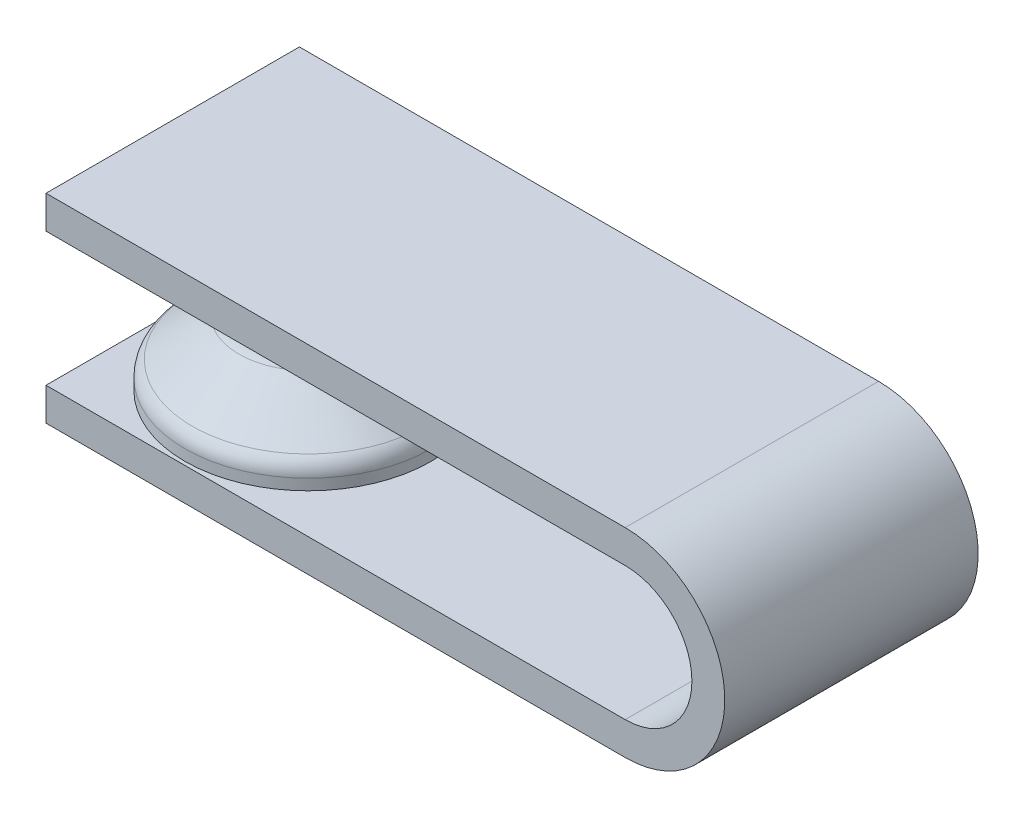
ISO-10303-21;
HEADER;
FILE_DESCRIPTION(('STEP AP214'),'2;1');
FILE_NAME('part.step','',(''),(''),'','','');
FILE_SCHEMA(('AUTOMOTIVE_DESIGN { 1 0 10303 214 1 1 1 1 }'));
ENDSEC;
DATA;
#1=APPLICATION_CONTEXT('core data for automotive mechanical design processes');
#2=APPLICATION_PROTOCOL_DEFINITION('international standard','automotive_design',2000,#1);
#3=PRODUCT_CONTEXT('',#1,'mechanical');
#4=PRODUCT('Part','Part','',(#3));
#5=PRODUCT_RELATED_PRODUCT_CATEGORY('part','',(#4));
#6=PRODUCT_DEFINITION_FORMATION('','',#4);
#7=PRODUCT_DEFINITION_CONTEXT('part definition',#1,'design');
#8=PRODUCT_DEFINITION('design','',#6,#7);
#9=PRODUCT_DEFINITION_SHAPE('','',#8);
#10=(LENGTH_UNIT() NAMED_UNIT(*) SI_UNIT(.MILLI.,.METRE.));
#11=(NAMED_UNIT(*) PLANE_ANGLE_UNIT() SI_UNIT($,.RADIAN.));
#12=(NAMED_UNIT(*) SI_UNIT($,.STERADIAN.) SOLID_ANGLE_UNIT());
#13=UNCERTAINTY_MEASURE_WITH_UNIT(LENGTH_MEASURE(1.E-05),#10,'distance_accuracy_value','');
#14=(GEOMETRIC_REPRESENTATION_CONTEXT(3) GLOBAL_UNCERTAINTY_ASSIGNED_CONTEXT((#13)) GLOBAL_UNIT_ASSIGNED_CONTEXT((#10,
#11,#12)) REPRESENTATION_CONTEXT('',''));
#15=CARTESIAN_POINT('',(0.,0.,0.));
#16=DIRECTION('',(0.,0.,1.));
#17=DIRECTION('',(1.,0.,0.));
#18=AXIS2_PLACEMENT_3D('',#15,#16,#17);
#19=CARTESIAN_POINT('',(0.,-1.,0.));
#20=DIRECTION('',(0.,-1.,0.));
#21=DIRECTION('',(1.,0.,0.));
#22=AXIS2_PLACEMENT_3D('',#19,#20,#21);
#23=CYLINDRICAL_SURFACE('',#22,3.);
#24=CARTESIAN_POINT('',(0.,4.,0.));
#25=DIRECTION('',(0.,-1.,0.));
#26=DIRECTION('',(1.,0.,0.));
#27=AXIS2_PLACEMENT_3D('',#24,#25,#26);
#28=CIRCLE('',#27,3.);
#29=CARTESIAN_POINT('',(3.,4.,0.));
#30=VERTEX_POINT('',#29);
#31=EDGE_CURVE('E142',#30,#30,#28,.T.);
#32=ORIENTED_EDGE('',*,*,#31,.T.);
#33=EDGE_LOOP('',(#32));
#34=FACE_BOUND('',#33,.T.);
#35=CARTESIAN_POINT('',(0.,2.96837494598444,0.));
#36=DIRECTION('',(0.,-1.,0.));
#37=DIRECTION('',(1.,0.,0.));
#38=AXIS2_PLACEMENT_3D('',#35,#36,#37);
#39=CIRCLE('',#38,3.);
#40=CARTESIAN_POINT('',(3.,2.96837494598444,0.));
#41=VERTEX_POINT('',#40);
#42=EDGE_CURVE('E139',#41,#41,#39,.F.);
#43=ORIENTED_EDGE('',*,*,#42,.T.);
#44=EDGE_LOOP('',(#43));
#45=FACE_BOUND('',#44,.T.);
#46=ADVANCED_FACE('F35',(#34,#45),#23,.T.);
#47=CARTESIAN_POINT('',(0.,2.5,0.));
#48=DIRECTION('',(0.,-1.,0.));
#49=DIRECTION('',(1.,0.,0.));
#50=AXIS2_PLACEMENT_3D('',#47,#48,#49);
#51=CONICAL_SURFACE('',#50,3.,0.876058050598194);
#52=CARTESIAN_POINT('',(0.,2.20015366638707,0.));
#53=DIRECTION('',(0.,-1.,0.));
#54=DIRECTION('',(1.,0.,0.));
#55=AXIS2_PLACEMENT_3D('',#52,#53,#54);
#56=CIRCLE('',#55,3.35981560033552);
#57=CARTESIAN_POINT('',(3.35981560033552,2.20015366638707,0.));
#58=VERTEX_POINT('',#57);
#59=EDGE_CURVE('E44',#58,#58,#56,.T.);
#60=ORIENTED_EDGE('',*,*,#59,.T.);
#61=EDGE_LOOP('',(#60));
#62=FACE_BOUND('',#61,.T.);
#63=CARTESIAN_POINT('',(0.,0.299846333612934,0.));
#64=DIRECTION('',(0.,1.,0.));
#65=DIRECTION('',(-1.,0.,0.));
#66=AXIS2_PLACEMENT_3D('',#63,#64,#65);
#67=CIRCLE('',#66,5.64018439966448);
#68=CARTESIAN_POINT('',(-5.64018439966448,0.299846333612934,0.));
#69=VERTEX_POINT('',#68);
#70=EDGE_CURVE('E148',#69,#69,#67,.T.);
#71=ORIENTED_EDGE('',*,*,#70,.T.);
#72=EDGE_LOOP('',(#71));
#73=FACE_BOUND('',#72,.T.);
#74=ADVANCED_FACE('F153',(#62,#73),#51,.T.);
#75=CARTESIAN_POINT('',(0.,-1.,0.));
#76=DIRECTION('',(0.,-1.,0.));
#77=DIRECTION('',(1.,0.,0.));
#78=AXIS2_PLACEMENT_3D('',#75,#76,#77);
#79=CYLINDRICAL_SURFACE('',#78,6.);
#80=CARTESIAN_POINT('',(0.,-0.468374945984442,0.));
#81=DIRECTION('',(0.,1.,0.));
#82=DIRECTION('',(-1.,0.,0.));
#83=AXIS2_PLACEMENT_3D('',#80,#81,#82);
#84=CIRCLE('',#83,6.);
#85=CARTESIAN_POINT('',(-6.,-0.468374945984443,0.));
#86=VERTEX_POINT('',#85);
#87=EDGE_CURVE('E11',#86,#86,#84,.F.);
#88=ORIENTED_EDGE('',*,*,#87,.T.);
#89=EDGE_LOOP('',(#88));
#90=FACE_BOUND('',#89,.T.);
#91=CARTESIAN_POINT('',(0.,-0.999999999999999,0.));
#92=DIRECTION('',(0.,-1.,0.));
#93=DIRECTION('',(1.,0.,0.));
#94=AXIS2_PLACEMENT_3D('',#91,#92,#93);
#95=CIRCLE('',#94,6.);
#96=CARTESIAN_POINT('',(6.,-0.999999999999998,0.));
#97=VERTEX_POINT('',#96);
#98=EDGE_CURVE('E136',#97,#97,#95,.T.);
#99=ORIENTED_EDGE('',*,*,#98,.F.);
#100=EDGE_LOOP('',(#99));
#101=FACE_BOUND('',#100,.T.);
#102=ADVANCED_FACE('F176',(#90,#101),#79,.T.);
#103=CARTESIAN_POINT('',(0.,5.,0.));
#104=DIRECTION('',(0.,-1.,0.));
#105=DIRECTION('',(1.,0.,0.));
#106=AXIS2_PLACEMENT_3D('',#103,#104,#105);
#107=PLANE('',#106);
#108=CARTESIAN_POINT('',(0.,5.,0.));
#109=DIRECTION('',(0.,-1.,0.));
#110=DIRECTION('',(1.,0.,0.));
#111=AXIS2_PLACEMENT_3D('',#108,#109,#110);
#112=CIRCLE('',#111,2.);
#113=CARTESIAN_POINT('',(2.,5.,0.));
#114=VERTEX_POINT('',#113);
#115=EDGE_CURVE('E145',#114,#114,#112,.F.);
#116=ORIENTED_EDGE('',*,*,#115,.T.);
#117=EDGE_LOOP('',(#116));
#118=FACE_BOUND('',#117,.T.);
#119=ADVANCED_FACE('F166',(#118),#107,.F.);
#120=CARTESIAN_POINT('',(0.,4.,0.));
#121=DIRECTION('',(0.,-1.,0.));
#122=DIRECTION('',(1.,0.,0.));
#123=AXIS2_PLACEMENT_3D('',#120,#121,#122);
#124=TOROIDAL_SURFACE('',#123,2.,1.);
#125=ORIENTED_EDGE('',*,*,#115,.F.);
#126=EDGE_LOOP('',(#125));
#127=FACE_BOUND('',#126,.T.);
#128=ORIENTED_EDGE('',*,*,#31,.F.);
#129=EDGE_LOOP('',(#128));
#130=FACE_BOUND('',#129,.T.);
#131=ADVANCED_FACE('F158',(#127,#130),#124,.T.);
#132=CARTESIAN_POINT('',(0.,2.96837494598444,0.));
#133=DIRECTION('',(0.,-1.,0.));
#134=DIRECTION('',(1.,0.,0.));
#135=AXIS2_PLACEMENT_3D('',#132,#133,#134);
#136=TOROIDAL_SURFACE('',#135,4.,1.);
#137=ORIENTED_EDGE('',*,*,#42,.F.);
#138=EDGE_LOOP('',(#137));
#139=FACE_BOUND('',#138,.T.);
#140=ORIENTED_EDGE('',*,*,#59,.F.);
#141=EDGE_LOOP('',(#140));
#142=FACE_BOUND('',#141,.T.);
#143=ADVANCED_FACE('F156',(#139,#142),#136,.F.);
#144=CARTESIAN_POINT('',(0.,-0.468374945984442,0.));
#145=DIRECTION('',(0.,1.,0.));
#146=DIRECTION('',(-1.,0.,0.));
#147=AXIS2_PLACEMENT_3D('',#144,#145,#146);
#148=TOROIDAL_SURFACE('',#147,5.,1.);
#149=ORIENTED_EDGE('',*,*,#70,.F.);
#150=EDGE_LOOP('',(#149));
#151=FACE_BOUND('',#150,.T.);
#152=ORIENTED_EDGE('',*,*,#87,.F.);
#153=EDGE_LOOP('',(#152));
#154=FACE_BOUND('',#153,.T.);
#155=ADVANCED_FACE('F37',(#151,#154),#148,.T.);
#156=CARTESIAN_POINT('',(-6.59323512510923,-2.6,6.17069615537602));
#157=DIRECTION('',(0.,0.,-1.));
#158=DIRECTION('',(-1.,0.,0.));
#159=AXIS2_PLACEMENT_3D('',#156,#157,#158);
#160=PLANE('',#159);
#161=DIRECTION('',(-1.,0.,0.));
#162=VECTOR('',#161,1.);
#163=CARTESIAN_POINT('',(-6.59323512510923,-1.,6.17069615537602));
#164=LINE('',#163,#162);
#165=CARTESIAN_POINT('',(21.6163662570743,-0.999999999999999,6.17069615537602));
#166=VERTEX_POINT('',#165);
#167=CARTESIAN_POINT('',(-6.59323512510923,-1.,6.17069615537602));
#168=VERTEX_POINT('',#167);
#169=EDGE_CURVE('E63',#166,#168,#164,.T.);
#170=ORIENTED_EDGE('',*,*,#169,.T.);
#171=DIRECTION('',(0.,1.,0.));
#172=VECTOR('',#171,1.);
#173=CARTESIAN_POINT('',(-6.59323512510923,-2.6,6.17069615537602));
#174=LINE('',#173,#172);
#175=CARTESIAN_POINT('',(-6.59323512510923,-2.6,6.17069615537602));
#176=VERTEX_POINT('',#175);
#177=EDGE_CURVE('E134',#176,#168,#174,.T.);
#178=ORIENTED_EDGE('',*,*,#177,.F.);
#179=DIRECTION('',(-1.,0.,0.));
#180=VECTOR('',#179,1.);
#181=CARTESIAN_POINT('',(-6.59323512510923,-2.6,6.17069615537602));
#182=LINE('',#181,#180);
#183=CARTESIAN_POINT('',(21.6163662570743,-2.6,6.17069615537602));
#184=VERTEX_POINT('',#183);
#185=EDGE_CURVE('E124',#184,#176,#182,.T.);
#186=ORIENTED_EDGE('',*,*,#185,.F.);
#187=CARTESIAN_POINT('',(21.6163662570743,2.25,6.17069615537602));
#188=DIRECTION('',(0.,0.,1.));
#189=DIRECTION('',(-1.,0.,0.));
#190=AXIS2_PLACEMENT_3D('',#187,#188,#189);
#191=CIRCLE('',#190,4.85);
#192=CARTESIAN_POINT('',(21.6163662570743,7.1,6.17069615537602));
#193=VERTEX_POINT('',#192);
#194=EDGE_CURVE('E116',#184,#193,#191,.T.);
#195=ORIENTED_EDGE('',*,*,#194,.T.);
#196=DIRECTION('',(-1.,0.,0.));
#197=VECTOR('',#196,1.);
#198=CARTESIAN_POINT('',(6.59323512510923,7.1,6.17069615537602));
#199=LINE('',#198,#197);
#200=CARTESIAN_POINT('',(-6.59323512510923,7.1,6.17069615537602));
#201=VERTEX_POINT('',#200);
#202=EDGE_CURVE('E243',#193,#201,#199,.T.);
#203=ORIENTED_EDGE('',*,*,#202,.T.);
#204=DIRECTION('',(0.,-1.,0.));
#205=VECTOR('',#204,1.);
#206=CARTESIAN_POINT('',(-6.59323512510923,7.1,6.17069615537602));
#207=LINE('',#206,#205);
#208=CARTESIAN_POINT('',(-6.59323512510923,5.5,6.17069615537602));
#209=VERTEX_POINT('',#208);
#210=EDGE_CURVE('E228',#201,#209,#207,.T.);
#211=ORIENTED_EDGE('',*,*,#210,.T.);
#212=DIRECTION('',(1.,0.,0.));
#213=VECTOR('',#212,1.);
#214=CARTESIAN_POINT('',(6.59323512510923,5.5,6.17069615537602));
#215=LINE('',#214,#213);
#216=CARTESIAN_POINT('',(21.6163662570743,5.5,6.17069615537602));
#217=VERTEX_POINT('',#216);
#218=EDGE_CURVE('E119',#209,#217,#215,.T.);
#219=ORIENTED_EDGE('',*,*,#218,.T.);
#220=CARTESIAN_POINT('',(21.6163662570743,2.25,6.17069615537602));
#221=DIRECTION('',(0.,0.,-1.));
#222=DIRECTION('',(-1.,0.,0.));
#223=AXIS2_PLACEMENT_3D('',#220,#221,#222);
#224=CIRCLE('',#223,3.25);
#225=EDGE_CURVE('E117',#217,#166,#224,.T.);
#226=ORIENTED_EDGE('',*,*,#225,.T.);
#227=EDGE_LOOP('',(#170,#178,#186,#195,#203,#211,#219,#226));
#228=FACE_BOUND('',#227,.T.);
#229=ADVANCED_FACE('F164',(#228),#160,.F.);
#230=CARTESIAN_POINT('',(-6.59323512510923,-2.6,-6.17069615537602));
#231=DIRECTION('',(1.,0.,0.));
#232=DIRECTION('',(0.,1.,0.));
#233=AXIS2_PLACEMENT_3D('',#230,#231,#232);
#234=PLANE('',#233);
#235=DIRECTION('',(0.,0.,-1.));
#236=VECTOR('',#235,1.);
#237=CARTESIAN_POINT('',(-6.59323512510923,-1.,-6.17069615537602));
#238=LINE('',#237,#236);
#239=CARTESIAN_POINT('',(-6.59323512510923,-1.,-6.17069615537602));
#240=VERTEX_POINT('',#239);
#241=EDGE_CURVE('E129',#168,#240,#238,.T.);
#242=ORIENTED_EDGE('',*,*,#241,.T.);
#243=DIRECTION('',(0.,1.,0.));
#244=VECTOR('',#243,1.);
#245=CARTESIAN_POINT('',(-6.59323512510923,-2.6,-6.17069615537602));
#246=LINE('',#245,#244);
#247=CARTESIAN_POINT('',(-6.59323512510923,-2.6,-6.17069615537602));
#248=VERTEX_POINT('',#247);
#249=EDGE_CURVE('E106',#248,#240,#246,.T.);
#250=ORIENTED_EDGE('',*,*,#249,.F.);
#251=DIRECTION('',(0.,0.,-1.));
#252=VECTOR('',#251,1.);
#253=CARTESIAN_POINT('',(-6.59323512510923,-2.6,-6.17069615537602));
#254=LINE('',#253,#252);
#255=EDGE_CURVE('E52',#176,#248,#254,.T.);
#256=ORIENTED_EDGE('',*,*,#255,.F.);
#257=ORIENTED_EDGE('',*,*,#177,.T.);
#258=EDGE_LOOP('',(#242,#250,#256,#257));
#259=FACE_BOUND('',#258,.T.);
#260=ADVANCED_FACE('F188',(#259),#234,.F.);
#261=CARTESIAN_POINT('',(-6.59323512510923,-2.6,-6.17069615537602));
#262=DIRECTION('',(0.,0.,1.));
#263=DIRECTION('',(1.,0.,0.));
#264=AXIS2_PLACEMENT_3D('',#261,#262,#263);
#265=PLANE('',#264);
#266=DIRECTION('',(1.,0.,0.));
#267=VECTOR('',#266,1.);
#268=CARTESIAN_POINT('',(-6.59323512510923,-1.,-6.17069615537602));
#269=LINE('',#268,#267);
#270=CARTESIAN_POINT('',(21.6163662570743,-0.999999999999999,-6.17069615537602));
#271=VERTEX_POINT('',#270);
#272=EDGE_CURVE('E126',#240,#271,#269,.T.);
#273=ORIENTED_EDGE('',*,*,#272,.T.);
#274=CARTESIAN_POINT('',(21.6163662570743,2.25,-6.17069615537602));
#275=DIRECTION('',(0.,0.,-1.));
#276=DIRECTION('',(-1.,0.,0.));
#277=AXIS2_PLACEMENT_3D('',#274,#275,#276);
#278=CIRCLE('',#277,3.25);
#279=CARTESIAN_POINT('',(21.6163662570743,5.5,-6.17069615537602));
#280=VERTEX_POINT('',#279);
#281=EDGE_CURVE('E247',#280,#271,#278,.T.);
#282=ORIENTED_EDGE('',*,*,#281,.F.);
#283=DIRECTION('',(1.,0.,0.));
#284=VECTOR('',#283,1.);
#285=CARTESIAN_POINT('',(6.59323512510923,5.5,-6.17069615537602));
#286=LINE('',#285,#284);
#287=CARTESIAN_POINT('',(-6.59323512510923,5.5,-6.17069615537602));
#288=VERTEX_POINT('',#287);
#289=EDGE_CURVE('E251',#288,#280,#286,.T.);
#290=ORIENTED_EDGE('',*,*,#289,.F.);
#291=DIRECTION('',(0.,-1.,0.));
#292=VECTOR('',#291,1.);
#293=CARTESIAN_POINT('',(-6.59323512510923,7.1,-6.17069615537602));
#294=LINE('',#293,#292);
#295=CARTESIAN_POINT('',(-6.59323512510923,7.1,-6.17069615537602));
#296=VERTEX_POINT('',#295);
#297=EDGE_CURVE('E231',#296,#288,#294,.T.);
#298=ORIENTED_EDGE('',*,*,#297,.F.);
#299=DIRECTION('',(-1.,0.,0.));
#300=VECTOR('',#299,1.);
#301=CARTESIAN_POINT('',(6.59323512510923,7.1,-6.17069615537602));
#302=LINE('',#301,#300);
#303=CARTESIAN_POINT('',(21.6163662570743,7.1,-6.17069615537602));
#304=VERTEX_POINT('',#303);
#305=EDGE_CURVE('E96',#304,#296,#302,.T.);
#306=ORIENTED_EDGE('',*,*,#305,.F.);
#307=CARTESIAN_POINT('',(21.6163662570743,2.25,-6.17069615537602));
#308=DIRECTION('',(0.,0.,-1.));
#309=DIRECTION('',(-1.,0.,0.));
#310=AXIS2_PLACEMENT_3D('',#307,#308,#309);
#311=CIRCLE('',#310,4.85);
#312=CARTESIAN_POINT('',(21.6163662570743,-2.6,-6.17069615537602));
#313=VERTEX_POINT('',#312);
#314=EDGE_CURVE('E109',#313,#304,#311,.F.);
#315=ORIENTED_EDGE('',*,*,#314,.F.);
#316=DIRECTION('',(1.,0.,0.));
#317=VECTOR('',#316,1.);
#318=CARTESIAN_POINT('',(-6.59323512510923,-2.6,-6.17069615537602));
#319=LINE('',#318,#317);
#320=EDGE_CURVE('E100',#248,#313,#319,.T.);
#321=ORIENTED_EDGE('',*,*,#320,.F.);
#322=ORIENTED_EDGE('',*,*,#249,.T.);
#323=EDGE_LOOP('',(#273,#282,#290,#298,#306,#315,#321,#322));
#324=FACE_BOUND('',#323,.T.);
#325=ADVANCED_FACE('F110',(#324),#265,.F.);
#326=CARTESIAN_POINT('',(0.,-2.6,0.));
#327=DIRECTION('',(0.,1.,0.));
#328=DIRECTION('',(-1.,0.,0.));
#329=AXIS2_PLACEMENT_3D('',#326,#327,#328);
#330=PLANE('',#329);
#331=ORIENTED_EDGE('',*,*,#320,.T.);
#332=DIRECTION('',(0.,0.,1.));
#333=VECTOR('',#332,1.);
#334=CARTESIAN_POINT('',(21.6163662570743,-2.6,-28.2847491757583));
#335=LINE('',#334,#333);
#336=EDGE_CURVE('E103',#313,#184,#335,.T.);
#337=ORIENTED_EDGE('',*,*,#336,.T.);
#338=ORIENTED_EDGE('',*,*,#185,.T.);
#339=ORIENTED_EDGE('',*,*,#255,.T.);
#340=EDGE_LOOP('',(#331,#337,#338,#339));
#341=FACE_BOUND('',#340,.T.);
#342=ADVANCED_FACE('F101',(#341),#330,.F.);
#343=CARTESIAN_POINT('',(0.,-1.,0.));
#344=DIRECTION('',(0.,1.,0.));
#345=DIRECTION('',(-1.,0.,0.));
#346=AXIS2_PLACEMENT_3D('',#343,#344,#345);
#347=PLANE('',#346);
#348=ORIENTED_EDGE('',*,*,#98,.T.);
#349=EDGE_LOOP('',(#348));
#350=FACE_BOUND('',#349,.T.);
#351=ORIENTED_EDGE('',*,*,#169,.F.);
#352=DIRECTION('',(0.,0.,1.));
#353=VECTOR('',#352,1.);
#354=CARTESIAN_POINT('',(21.6163662570743,-0.999999999999999,-28.2847491757583));
#355=LINE('',#354,#353);
#356=EDGE_CURVE('E130',#271,#166,#355,.T.);
#357=ORIENTED_EDGE('',*,*,#356,.F.);
#358=ORIENTED_EDGE('',*,*,#272,.F.);
#359=ORIENTED_EDGE('',*,*,#241,.F.);
#360=EDGE_LOOP('',(#351,#357,#358,#359));
#361=FACE_BOUND('',#360,.T.);
#362=ADVANCED_FACE('F194',(#350,#361),#347,.T.);
#363=CARTESIAN_POINT('',(21.6163662570743,2.25,-28.2847491757583));
#364=DIRECTION('',(0.,0.,1.));
#365=DIRECTION('',(1.,0.,0.));
#366=AXIS2_PLACEMENT_3D('',#363,#364,#365);
#367=CYLINDRICAL_SURFACE('',#366,4.85);
#368=ORIENTED_EDGE('',*,*,#336,.F.);
#369=ORIENTED_EDGE('',*,*,#314,.T.);
#370=DIRECTION('',(0.,0.,1.));
#371=VECTOR('',#370,1.);
#372=CARTESIAN_POINT('',(21.6163662570743,7.1,-28.2847491757583));
#373=LINE('',#372,#371);
#374=EDGE_CURVE('E112',#304,#193,#373,.T.);
#375=ORIENTED_EDGE('',*,*,#374,.T.);
#376=ORIENTED_EDGE('',*,*,#194,.F.);
#377=EDGE_LOOP('',(#368,#369,#375,#376));
#378=FACE_BOUND('',#377,.T.);
#379=ADVANCED_FACE('F114',(#378),#367,.T.);
#380=CARTESIAN_POINT('',(6.59323512510923,7.1,-28.2847491757583));
#381=DIRECTION('',(0.,1.,0.));
#382=DIRECTION('',(-1.,0.,0.));
#383=AXIS2_PLACEMENT_3D('',#380,#381,#382);
#384=PLANE('',#383);
#385=ORIENTED_EDGE('',*,*,#374,.F.);
#386=ORIENTED_EDGE('',*,*,#305,.T.);
#387=DIRECTION('',(0.,0.,-1.));
#388=VECTOR('',#387,1.);
#389=CARTESIAN_POINT('',(-6.59323512510923,7.1,-6.17069615537602));
#390=LINE('',#389,#388);
#391=EDGE_CURVE('E235',#201,#296,#390,.T.);
#392=ORIENTED_EDGE('',*,*,#391,.F.);
#393=ORIENTED_EDGE('',*,*,#202,.F.);
#394=EDGE_LOOP('',(#385,#386,#392,#393));
#395=FACE_BOUND('',#394,.T.);
#396=ADVANCED_FACE('F202',(#395),#384,.T.);
#397=CARTESIAN_POINT('',(6.59323512510923,5.5,-28.2847491757583));
#398=DIRECTION('',(0.,-1.,0.));
#399=DIRECTION('',(0.,0.,-1.));
#400=AXIS2_PLACEMENT_3D('',#397,#398,#399);
#401=PLANE('',#400);
#402=ORIENTED_EDGE('',*,*,#218,.F.);
#403=DIRECTION('',(0.,0.,-1.));
#404=VECTOR('',#403,1.);
#405=CARTESIAN_POINT('',(-6.59323512510923,5.5,-6.17069615537602));
#406=LINE('',#405,#404);
#407=EDGE_CURVE('E224',#209,#288,#406,.T.);
#408=ORIENTED_EDGE('',*,*,#407,.T.);
#409=ORIENTED_EDGE('',*,*,#289,.T.);
#410=DIRECTION('',(0.,0.,1.));
#411=VECTOR('',#410,1.);
#412=CARTESIAN_POINT('',(21.6163662570743,5.5,-28.2847491757583));
#413=LINE('',#412,#411);
#414=EDGE_CURVE('E250',#280,#217,#413,.T.);
#415=ORIENTED_EDGE('',*,*,#414,.T.);
#416=EDGE_LOOP('',(#402,#408,#409,#415));
#417=FACE_BOUND('',#416,.T.);
#418=ADVANCED_FACE('F205',(#417),#401,.T.);
#419=CARTESIAN_POINT('',(21.6163662570743,2.25,-28.2847491757583));
#420=DIRECTION('',(0.,0.,1.));
#421=DIRECTION('',(1.,0.,0.));
#422=AXIS2_PLACEMENT_3D('',#419,#420,#421);
#423=CYLINDRICAL_SURFACE('',#422,3.25);
#424=ORIENTED_EDGE('',*,*,#414,.F.);
#425=ORIENTED_EDGE('',*,*,#281,.T.);
#426=ORIENTED_EDGE('',*,*,#356,.T.);
#427=ORIENTED_EDGE('',*,*,#225,.F.);
#428=EDGE_LOOP('',(#424,#425,#426,#427));
#429=FACE_BOUND('',#428,.T.);
#430=ADVANCED_FACE('F209',(#429),#423,.F.);
#431=CARTESIAN_POINT('',(-6.59323512510923,7.1,-6.17069615537602));
#432=DIRECTION('',(-1.,0.,0.));
#433=DIRECTION('',(0.,-1.,0.));
#434=AXIS2_PLACEMENT_3D('',#431,#432,#433);
#435=PLANE('',#434);
#436=ORIENTED_EDGE('',*,*,#407,.F.);
#437=ORIENTED_EDGE('',*,*,#210,.F.);
#438=ORIENTED_EDGE('',*,*,#391,.T.);
#439=ORIENTED_EDGE('',*,*,#297,.T.);
#440=EDGE_LOOP('',(#436,#437,#438,#439));
#441=FACE_BOUND('',#440,.T.);
#442=ADVANCED_FACE('F213',(#441),#435,.T.);
#443=CLOSED_SHELL('',(#46,#74,#102,#119,#131,#143,#155,#229,#260,#325,#342,#362,#379,#396,#418,
#430,#442));
#444=MANIFOLD_SOLID_BREP('B2',#443);
#445=ADVANCED_BREP_SHAPE_REPRESENTATION('',(#18,#444),#14);
#446=SHAPE_DEFINITION_REPRESENTATION(#9,#445);
ENDSEC;
END-ISO-10303-21;
